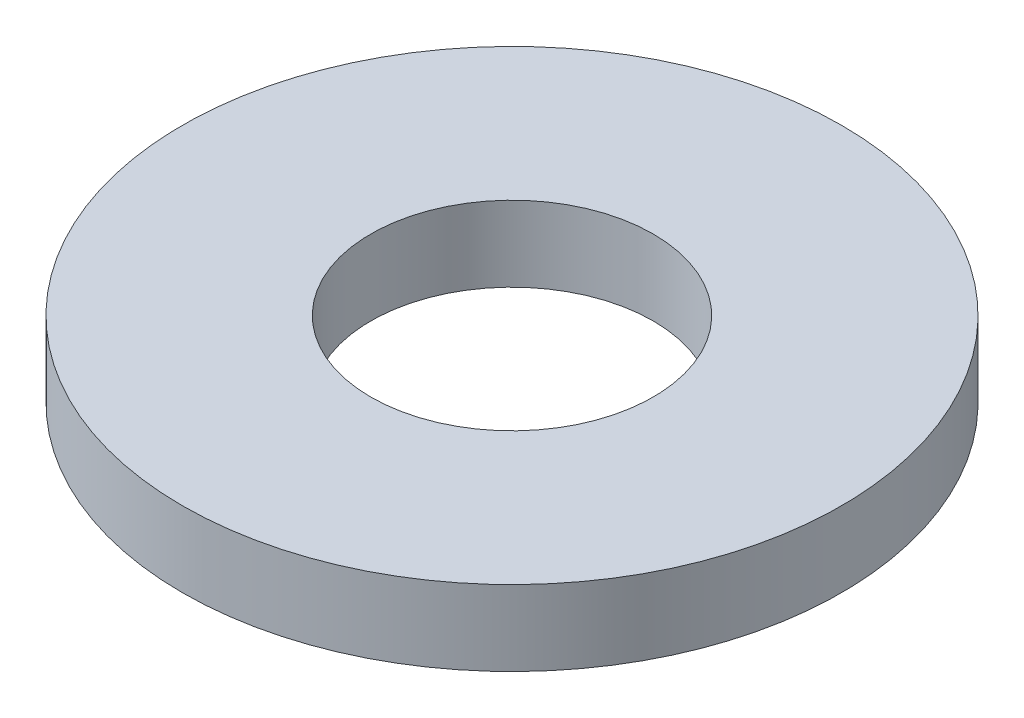
ISO-10303-21;
HEADER;
FILE_DESCRIPTION(('STEP AP214'),'2;1');
FILE_NAME('part.step','',(''),(''),'','','');
FILE_SCHEMA(('AUTOMOTIVE_DESIGN { 1 0 10303 214 1 1 1 1 }'));
ENDSEC;
DATA;
#1=APPLICATION_CONTEXT('core data for automotive mechanical design processes');
#2=APPLICATION_PROTOCOL_DEFINITION('international standard','automotive_design',2000,#1);
#3=PRODUCT_CONTEXT('',#1,'mechanical');
#4=PRODUCT('Part','Part','',(#3));
#5=PRODUCT_RELATED_PRODUCT_CATEGORY('part','',(#4));
#6=PRODUCT_DEFINITION_FORMATION('','',#4);
#7=PRODUCT_DEFINITION_CONTEXT('part definition',#1,'design');
#8=PRODUCT_DEFINITION('design','',#6,#7);
#9=PRODUCT_DEFINITION_SHAPE('','',#8);
#10=(LENGTH_UNIT() NAMED_UNIT(*) SI_UNIT(.MILLI.,.METRE.));
#11=(NAMED_UNIT(*) PLANE_ANGLE_UNIT() SI_UNIT($,.RADIAN.));
#12=(NAMED_UNIT(*) SI_UNIT($,.STERADIAN.) SOLID_ANGLE_UNIT());
#13=UNCERTAINTY_MEASURE_WITH_UNIT(LENGTH_MEASURE(1.E-05),#10,'distance_accuracy_value','');
#14=(GEOMETRIC_REPRESENTATION_CONTEXT(3) GLOBAL_UNCERTAINTY_ASSIGNED_CONTEXT((#13)) GLOBAL_UNIT_ASSIGNED_CONTEXT((#10,
#11,#12)) REPRESENTATION_CONTEXT('',''));
#15=CARTESIAN_POINT('',(0.,0.,0.));
#16=DIRECTION('',(0.,0.,1.));
#17=DIRECTION('',(1.,0.,0.));
#18=AXIS2_PLACEMENT_3D('',#15,#16,#17);
#19=CARTESIAN_POINT('',(0.,0.8,0.));
#20=DIRECTION('',(0.,1.,0.));
#21=DIRECTION('',(0.,0.,1.));
#22=AXIS2_PLACEMENT_3D('',#19,#20,#21);
#23=PLANE('',#22);
#24=CARTESIAN_POINT('',(0.,0.8,0.));
#25=DIRECTION('',(0.,1.,0.));
#26=DIRECTION('',(0.,0.,1.));
#27=AXIS2_PLACEMENT_3D('',#24,#25,#26);
#28=CIRCLE('',#27,3.5);
#29=CARTESIAN_POINT('',(0.,0.8,3.5));
#30=VERTEX_POINT('',#29);
#31=EDGE_CURVE('E10',#30,#30,#28,.T.);
#32=ORIENTED_EDGE('',*,*,#31,.T.);
#33=EDGE_LOOP('',(#32));
#34=FACE_BOUND('',#33,.T.);
#35=CARTESIAN_POINT('',(0.,0.8,0.));
#36=DIRECTION('',(0.,1.,0.));
#37=DIRECTION('',(0.,0.,1.));
#38=AXIS2_PLACEMENT_3D('',#35,#36,#37);
#39=CIRCLE('',#38,1.5);
#40=CARTESIAN_POINT('',(0.,0.8,1.5));
#41=VERTEX_POINT('',#40);
#42=EDGE_CURVE('E43',#41,#41,#39,.T.);
#43=ORIENTED_EDGE('',*,*,#42,.F.);
#44=EDGE_LOOP('',(#43));
#45=FACE_BOUND('',#44,.T.);
#46=ADVANCED_FACE('F32',(#34,#45),#23,.T.);
#47=CARTESIAN_POINT('',(0.,0.,0.));
#48=DIRECTION('',(0.,1.,0.));
#49=DIRECTION('',(0.,0.,1.));
#50=AXIS2_PLACEMENT_3D('',#47,#48,#49);
#51=PLANE('',#50);
#52=CARTESIAN_POINT('',(0.,0.,0.));
#53=DIRECTION('',(0.,1.,0.));
#54=DIRECTION('',(0.,0.,1.));
#55=AXIS2_PLACEMENT_3D('',#52,#53,#54);
#56=CIRCLE('',#55,3.5);
#57=CARTESIAN_POINT('',(0.,0.,3.5));
#58=VERTEX_POINT('',#57);
#59=EDGE_CURVE('E36',#58,#58,#56,.T.);
#60=ORIENTED_EDGE('',*,*,#59,.F.);
#61=EDGE_LOOP('',(#60));
#62=FACE_BOUND('',#61,.T.);
#63=CARTESIAN_POINT('',(0.,0.,0.));
#64=DIRECTION('',(0.,1.,0.));
#65=DIRECTION('',(0.,0.,1.));
#66=AXIS2_PLACEMENT_3D('',#63,#64,#65);
#67=CIRCLE('',#66,1.5);
#68=CARTESIAN_POINT('',(0.,0.,1.5));
#69=VERTEX_POINT('',#68);
#70=EDGE_CURVE('E45',#69,#69,#67,.T.);
#71=ORIENTED_EDGE('',*,*,#70,.T.);
#72=EDGE_LOOP('',(#71));
#73=FACE_BOUND('',#72,.T.);
#74=ADVANCED_FACE('F55',(#62,#73),#51,.F.);
#75=CARTESIAN_POINT('',(0.,0.8,0.));
#76=DIRECTION('',(0.,-1.,0.));
#77=DIRECTION('',(0.,0.,-1.));
#78=AXIS2_PLACEMENT_3D('',#75,#76,#77);
#79=CYLINDRICAL_SURFACE('',#78,3.5);
#80=ORIENTED_EDGE('',*,*,#31,.F.);
#81=EDGE_LOOP('',(#80));
#82=FACE_BOUND('',#81,.T.);
#83=ORIENTED_EDGE('',*,*,#59,.T.);
#84=EDGE_LOOP('',(#83));
#85=FACE_BOUND('',#84,.T.);
#86=ADVANCED_FACE('F34',(#82,#85),#79,.T.);
#87=CARTESIAN_POINT('',(0.,0.8,0.));
#88=DIRECTION('',(0.,-1.,0.));
#89=DIRECTION('',(0.,0.,-1.));
#90=AXIS2_PLACEMENT_3D('',#87,#88,#89);
#91=CYLINDRICAL_SURFACE('',#90,1.5);
#92=ORIENTED_EDGE('',*,*,#42,.T.);
#93=EDGE_LOOP('',(#92));
#94=FACE_BOUND('',#93,.T.);
#95=ORIENTED_EDGE('',*,*,#70,.F.);
#96=EDGE_LOOP('',(#95));
#97=FACE_BOUND('',#96,.T.);
#98=ADVANCED_FACE('F51',(#94,#97),#91,.F.);
#99=CLOSED_SHELL('',(#46,#74,#86,#98));
#100=MANIFOLD_SOLID_BREP('B2',#99);
#101=ADVANCED_BREP_SHAPE_REPRESENTATION('',(#18,#100),#14);
#102=SHAPE_DEFINITION_REPRESENTATION(#9,#101);
ENDSEC;
END-ISO-10303-21;
